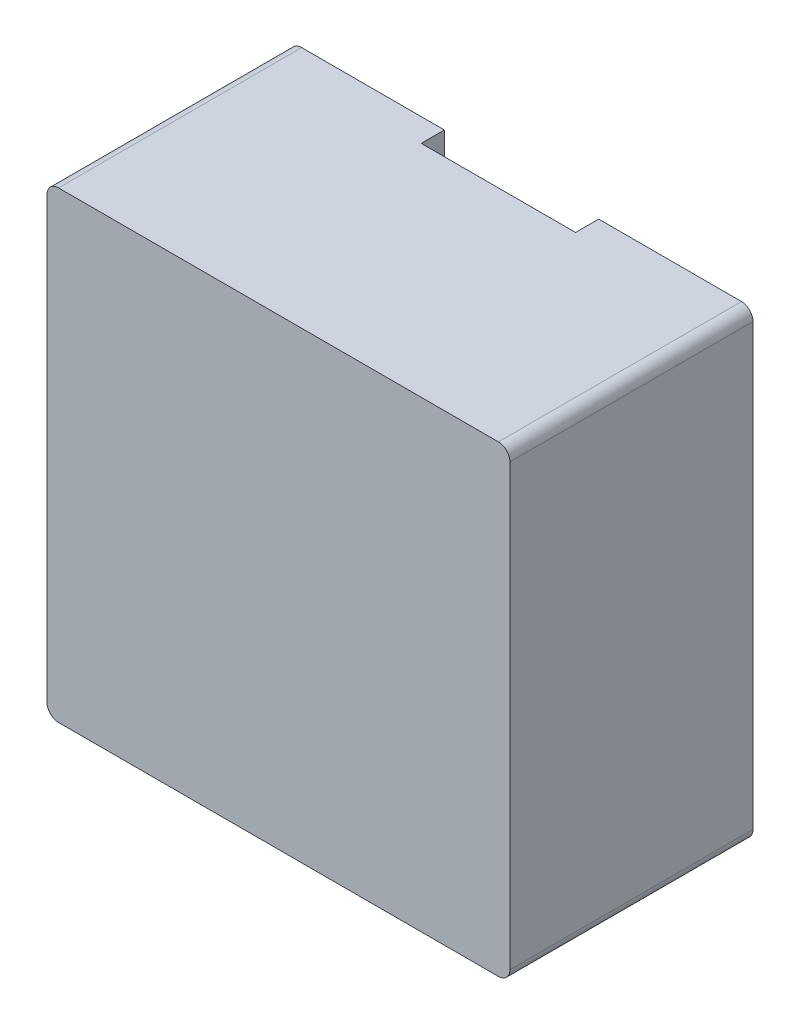
ISO-10303-21;
HEADER;
FILE_DESCRIPTION(('STEP AP214'),'2;1');
FILE_NAME('part.step','',(''),(''),'','','');
FILE_SCHEMA(('AUTOMOTIVE_DESIGN { 1 0 10303 214 1 1 1 1 }'));
ENDSEC;
DATA;
#1=APPLICATION_CONTEXT('core data for automotive mechanical design processes');
#2=APPLICATION_PROTOCOL_DEFINITION('international standard','automotive_design',2000,#1);
#3=PRODUCT_CONTEXT('',#1,'mechanical');
#4=PRODUCT('Part','Part','',(#3));
#5=PRODUCT_RELATED_PRODUCT_CATEGORY('part','',(#4));
#6=PRODUCT_DEFINITION_FORMATION('','',#4);
#7=PRODUCT_DEFINITION_CONTEXT('part definition',#1,'design');
#8=PRODUCT_DEFINITION('design','',#6,#7);
#9=PRODUCT_DEFINITION_SHAPE('','',#8);
#10=(LENGTH_UNIT() NAMED_UNIT(*) SI_UNIT(.MILLI.,.METRE.));
#11=(NAMED_UNIT(*) PLANE_ANGLE_UNIT() SI_UNIT($,.RADIAN.));
#12=(NAMED_UNIT(*) SI_UNIT($,.STERADIAN.) SOLID_ANGLE_UNIT());
#13=UNCERTAINTY_MEASURE_WITH_UNIT(LENGTH_MEASURE(1.E-05),#10,'distance_accuracy_value','');
#14=(GEOMETRIC_REPRESENTATION_CONTEXT(3) GLOBAL_UNCERTAINTY_ASSIGNED_CONTEXT((#13)) GLOBAL_UNIT_ASSIGNED_CONTEXT((#10,
#11,#12)) REPRESENTATION_CONTEXT('',''));
#15=CARTESIAN_POINT('',(0.,0.,0.));
#16=DIRECTION('',(0.,0.,1.));
#17=DIRECTION('',(1.,0.,0.));
#18=AXIS2_PLACEMENT_3D('',#15,#16,#17);
#19=CARTESIAN_POINT('',(1.,0.,0.));
#20=DIRECTION('',(-1.,0.,0.));
#21=DIRECTION('',(0.,0.,1.));
#22=AXIS2_PLACEMENT_3D('',#19,#20,#21);
#23=PLANE('',#22);
#24=DIRECTION('',(0.,1.,0.));
#25=VECTOR('',#24,1.);
#26=CARTESIAN_POINT('',(1.,0.,0.));
#27=LINE('',#26,#25);
#28=CARTESIAN_POINT('',(1.,-3.,0.));
#29=VERTEX_POINT('',#28);
#30=CARTESIAN_POINT('',(1.,3.,0.));
#31=VERTEX_POINT('',#30);
#32=EDGE_CURVE('E136',#29,#31,#27,.T.);
#33=ORIENTED_EDGE('',*,*,#32,.F.);
#34=DIRECTION('',(0.,0.,1.));
#35=VECTOR('',#34,1.);
#36=CARTESIAN_POINT('',(1.,-3.,0.));
#37=LINE('',#36,#35);
#38=CARTESIAN_POINT('',(1.,-3.,0.3));
#39=VERTEX_POINT('',#38);
#40=EDGE_CURVE('E164',#29,#39,#37,.T.);
#41=ORIENTED_EDGE('',*,*,#40,.T.);
#42=DIRECTION('',(0.,1.,0.));
#43=VECTOR('',#42,1.);
#44=CARTESIAN_POINT('',(1.,0.,0.3));
#45=LINE('',#44,#43);
#46=CARTESIAN_POINT('',(1.,3.,0.3));
#47=VERTEX_POINT('',#46);
#48=EDGE_CURVE('E140',#47,#39,#45,.F.);
#49=ORIENTED_EDGE('',*,*,#48,.F.);
#50=DIRECTION('',(0.,0.,1.));
#51=VECTOR('',#50,1.);
#52=CARTESIAN_POINT('',(1.,3.,0.));
#53=LINE('',#52,#51);
#54=EDGE_CURVE('E173',#47,#31,#53,.F.);
#55=ORIENTED_EDGE('',*,*,#54,.T.);
#56=EDGE_LOOP('',(#33,#41,#49,#55));
#57=FACE_BOUND('',#56,.T.);
#58=ADVANCED_FACE('F16',(#57),#23,.T.);
#59=CARTESIAN_POINT('',(-1.,0.,0.));
#60=DIRECTION('',(1.,0.,0.));
#61=DIRECTION('',(0.,0.,-1.));
#62=AXIS2_PLACEMENT_3D('',#59,#60,#61);
#63=PLANE('',#62);
#64=DIRECTION('',(0.,1.,0.));
#65=VECTOR('',#64,1.);
#66=CARTESIAN_POINT('',(-1.,0.,0.3));
#67=LINE('',#66,#65);
#68=CARTESIAN_POINT('',(-1.,-3.,0.3));
#69=VERTEX_POINT('',#68);
#70=CARTESIAN_POINT('',(-1.,3.,0.3));
#71=VERTEX_POINT('',#70);
#72=EDGE_CURVE('E180',#69,#71,#67,.T.);
#73=ORIENTED_EDGE('',*,*,#72,.F.);
#74=DIRECTION('',(0.,0.,-1.));
#75=VECTOR('',#74,1.);
#76=CARTESIAN_POINT('',(-1.,-3.,0.));
#77=LINE('',#76,#75);
#78=CARTESIAN_POINT('',(-1.,-3.,0.));
#79=VERTEX_POINT('',#78);
#80=EDGE_CURVE('E163',#69,#79,#77,.T.);
#81=ORIENTED_EDGE('',*,*,#80,.T.);
#82=DIRECTION('',(0.,1.,0.));
#83=VECTOR('',#82,1.);
#84=CARTESIAN_POINT('',(-1.,0.,0.));
#85=LINE('',#84,#83);
#86=CARTESIAN_POINT('',(-1.,3.,0.));
#87=VERTEX_POINT('',#86);
#88=EDGE_CURVE('E100',#87,#79,#85,.F.);
#89=ORIENTED_EDGE('',*,*,#88,.F.);
#90=DIRECTION('',(0.,0.,-1.));
#91=VECTOR('',#90,1.);
#92=CARTESIAN_POINT('',(-1.,3.,0.));
#93=LINE('',#92,#91);
#94=EDGE_CURVE('E109',#87,#71,#93,.F.);
#95=ORIENTED_EDGE('',*,*,#94,.T.);
#96=EDGE_LOOP('',(#73,#81,#89,#95));
#97=FACE_BOUND('',#96,.T.);
#98=ADVANCED_FACE('F240',(#97),#63,.T.);
#99=CARTESIAN_POINT('',(2.85,2.85,0.));
#100=DIRECTION('',(0.,0.,1.));
#101=DIRECTION('',(1.,0.,0.));
#102=AXIS2_PLACEMENT_3D('',#99,#100,#101);
#103=CYLINDRICAL_SURFACE('',#102,0.15);
#104=DIRECTION('',(0.,0.,-1.));
#105=VECTOR('',#104,1.);
#106=CARTESIAN_POINT('',(3.,2.85,0.));
#107=LINE('',#106,#105);
#108=CARTESIAN_POINT('',(3.,2.85,0.));
#109=VERTEX_POINT('',#108);
#110=CARTESIAN_POINT('',(3.,2.85,3.15));
#111=VERTEX_POINT('',#110);
#112=EDGE_CURVE('E111',#109,#111,#107,.F.);
#113=ORIENTED_EDGE('',*,*,#112,.F.);
#114=CARTESIAN_POINT('',(2.85,2.85,0.));
#115=DIRECTION('',(0.,0.,1.));
#116=DIRECTION('',(1.,0.,0.));
#117=AXIS2_PLACEMENT_3D('',#114,#115,#116);
#118=CIRCLE('',#117,0.15);
#119=CARTESIAN_POINT('',(2.85,3.,0.));
#120=VERTEX_POINT('',#119);
#121=EDGE_CURVE('E139',#120,#109,#118,.F.);
#122=ORIENTED_EDGE('',*,*,#121,.F.);
#123=DIRECTION('',(0.,0.,1.));
#124=VECTOR('',#123,1.);
#125=CARTESIAN_POINT('',(2.85,3.,0.));
#126=LINE('',#125,#124);
#127=CARTESIAN_POINT('',(2.85,3.,3.15));
#128=VERTEX_POINT('',#127);
#129=EDGE_CURVE('E115',#128,#120,#126,.F.);
#130=ORIENTED_EDGE('',*,*,#129,.F.);
#131=CARTESIAN_POINT('',(2.85,2.85,3.15));
#132=DIRECTION('',(0.,0.,1.));
#133=DIRECTION('',(1.,0.,0.));
#134=AXIS2_PLACEMENT_3D('',#131,#132,#133);
#135=CIRCLE('',#134,0.15);
#136=EDGE_CURVE('E19',#128,#111,#135,.F.);
#137=ORIENTED_EDGE('',*,*,#136,.T.);
#138=EDGE_LOOP('',(#113,#122,#130,#137));
#139=FACE_BOUND('',#138,.T.);
#140=ADVANCED_FACE('F208',(#139),#103,.T.);
#141=CARTESIAN_POINT('',(2.85,-2.85,0.));
#142=DIRECTION('',(0.,0.,1.));
#143=DIRECTION('',(1.,0.,0.));
#144=AXIS2_PLACEMENT_3D('',#141,#142,#143);
#145=CYLINDRICAL_SURFACE('',#144,0.15);
#146=DIRECTION('',(0.,0.,-1.));
#147=VECTOR('',#146,1.);
#148=CARTESIAN_POINT('',(2.85,-3.,0.));
#149=LINE('',#148,#147);
#150=CARTESIAN_POINT('',(2.85,-3.,0.));
#151=VERTEX_POINT('',#150);
#152=CARTESIAN_POINT('',(2.85,-3.,3.15));
#153=VERTEX_POINT('',#152);
#154=EDGE_CURVE('E154',#151,#153,#149,.F.);
#155=ORIENTED_EDGE('',*,*,#154,.F.);
#156=CARTESIAN_POINT('',(2.85,-2.85,0.));
#157=DIRECTION('',(0.,0.,1.));
#158=DIRECTION('',(1.,0.,0.));
#159=AXIS2_PLACEMENT_3D('',#156,#157,#158);
#160=CIRCLE('',#159,0.15);
#161=CARTESIAN_POINT('',(3.,-2.85,0.));
#162=VERTEX_POINT('',#161);
#163=EDGE_CURVE('E199',#162,#151,#160,.F.);
#164=ORIENTED_EDGE('',*,*,#163,.F.);
#165=DIRECTION('',(0.,0.,-1.));
#166=VECTOR('',#165,1.);
#167=CARTESIAN_POINT('',(3.,-2.85,0.));
#168=LINE('',#167,#166);
#169=CARTESIAN_POINT('',(3.,-2.85,3.15));
#170=VERTEX_POINT('',#169);
#171=EDGE_CURVE('E124',#170,#162,#168,.T.);
#172=ORIENTED_EDGE('',*,*,#171,.F.);
#173=CARTESIAN_POINT('',(2.85,-2.85,3.15));
#174=DIRECTION('',(0.,0.,1.));
#175=DIRECTION('',(1.,0.,0.));
#176=AXIS2_PLACEMENT_3D('',#173,#174,#175);
#177=CIRCLE('',#176,0.15);
#178=EDGE_CURVE('E183',#170,#153,#177,.F.);
#179=ORIENTED_EDGE('',*,*,#178,.T.);
#180=EDGE_LOOP('',(#155,#164,#172,#179));
#181=FACE_BOUND('',#180,.T.);
#182=ADVANCED_FACE('F260',(#181),#145,.T.);
#183=CARTESIAN_POINT('',(0.,0.,0.3));
#184=DIRECTION('',(0.,0.,-1.));
#185=DIRECTION('',(-1.,0.,0.));
#186=AXIS2_PLACEMENT_3D('',#183,#184,#185);
#187=PLANE('',#186);
#188=ORIENTED_EDGE('',*,*,#48,.T.);
#189=DIRECTION('',(1.,0.,0.));
#190=VECTOR('',#189,1.);
#191=CARTESIAN_POINT('',(0.,-3.,0.3));
#192=LINE('',#191,#190);
#193=EDGE_CURVE('E133',#69,#39,#192,.T.);
#194=ORIENTED_EDGE('',*,*,#193,.F.);
#195=ORIENTED_EDGE('',*,*,#72,.T.);
#196=DIRECTION('',(1.,0.,0.));
#197=VECTOR('',#196,1.);
#198=CARTESIAN_POINT('',(0.,3.,0.3));
#199=LINE('',#198,#197);
#200=EDGE_CURVE('E112',#47,#71,#199,.F.);
#201=ORIENTED_EDGE('',*,*,#200,.F.);
#202=EDGE_LOOP('',(#188,#194,#195,#201));
#203=FACE_BOUND('',#202,.T.);
#204=ADVANCED_FACE('F256',(#203),#187,.T.);
#205=CARTESIAN_POINT('',(0.,0.,0.));
#206=DIRECTION('',(0.,0.,-1.));
#207=DIRECTION('',(-1.,0.,0.));
#208=AXIS2_PLACEMENT_3D('',#205,#206,#207);
#209=PLANE('',#208);
#210=ORIENTED_EDGE('',*,*,#163,.T.);
#211=DIRECTION('',(1.,0.,0.));
#212=VECTOR('',#211,1.);
#213=CARTESIAN_POINT('',(0.,-3.,0.));
#214=LINE('',#213,#212);
#215=EDGE_CURVE('E130',#29,#151,#214,.T.);
#216=ORIENTED_EDGE('',*,*,#215,.F.);
#217=ORIENTED_EDGE('',*,*,#32,.T.);
#218=DIRECTION('',(1.,0.,0.));
#219=VECTOR('',#218,1.);
#220=CARTESIAN_POINT('',(0.,3.,0.));
#221=LINE('',#220,#219);
#222=EDGE_CURVE('E119',#120,#31,#221,.F.);
#223=ORIENTED_EDGE('',*,*,#222,.F.);
#224=ORIENTED_EDGE('',*,*,#121,.T.);
#225=DIRECTION('',(0.,1.,0.));
#226=VECTOR('',#225,1.);
#227=CARTESIAN_POINT('',(3.,0.,0.));
#228=LINE('',#227,#226);
#229=EDGE_CURVE('E152',#162,#109,#228,.T.);
#230=ORIENTED_EDGE('',*,*,#229,.F.);
#231=EDGE_LOOP('',(#210,#216,#217,#223,#224,#230));
#232=FACE_BOUND('',#231,.T.);
#233=ADVANCED_FACE('F259',(#232),#209,.T.);
#234=CARTESIAN_POINT('',(-2.85,2.85,0.));
#235=DIRECTION('',(0.,0.,1.));
#236=DIRECTION('',(1.,0.,0.));
#237=AXIS2_PLACEMENT_3D('',#234,#235,#236);
#238=CYLINDRICAL_SURFACE('',#237,0.15);
#239=DIRECTION('',(0.,0.,1.));
#240=VECTOR('',#239,1.);
#241=CARTESIAN_POINT('',(-3.,2.85,0.));
#242=LINE('',#241,#240);
#243=CARTESIAN_POINT('',(-3.,2.85,3.15));
#244=VERTEX_POINT('',#243);
#245=CARTESIAN_POINT('',(-3.,2.85,0.));
#246=VERTEX_POINT('',#245);
#247=EDGE_CURVE('E129',#244,#246,#242,.F.);
#248=ORIENTED_EDGE('',*,*,#247,.F.);
#249=CARTESIAN_POINT('',(-2.85,2.85,3.15));
#250=DIRECTION('',(0.,0.,1.));
#251=DIRECTION('',(1.,0.,0.));
#252=AXIS2_PLACEMENT_3D('',#249,#250,#251);
#253=CIRCLE('',#252,0.15);
#254=CARTESIAN_POINT('',(-2.85,3.,3.15));
#255=VERTEX_POINT('',#254);
#256=EDGE_CURVE('E34',#244,#255,#253,.F.);
#257=ORIENTED_EDGE('',*,*,#256,.T.);
#258=DIRECTION('',(0.,0.,1.));
#259=VECTOR('',#258,1.);
#260=CARTESIAN_POINT('',(-2.85,3.,0.));
#261=LINE('',#260,#259);
#262=CARTESIAN_POINT('',(-2.85,3.,0.));
#263=VERTEX_POINT('',#262);
#264=EDGE_CURVE('E106',#263,#255,#261,.T.);
#265=ORIENTED_EDGE('',*,*,#264,.F.);
#266=CARTESIAN_POINT('',(-2.85,2.85,0.));
#267=DIRECTION('',(0.,0.,1.));
#268=DIRECTION('',(1.,0.,0.));
#269=AXIS2_PLACEMENT_3D('',#266,#267,#268);
#270=CIRCLE('',#269,0.15);
#271=EDGE_CURVE('E94',#246,#263,#270,.F.);
#272=ORIENTED_EDGE('',*,*,#271,.F.);
#273=EDGE_LOOP('',(#248,#257,#265,#272));
#274=FACE_BOUND('',#273,.T.);
#275=ADVANCED_FACE('F114',(#274),#238,.T.);
#276=CARTESIAN_POINT('',(0.,0.,0.));
#277=DIRECTION('',(0.,0.,-1.));
#278=DIRECTION('',(-1.,0.,0.));
#279=AXIS2_PLACEMENT_3D('',#276,#277,#278);
#280=PLANE('',#279);
#281=ORIENTED_EDGE('',*,*,#271,.T.);
#282=DIRECTION('',(1.,0.,0.));
#283=VECTOR('',#282,1.);
#284=CARTESIAN_POINT('',(0.,3.,0.));
#285=LINE('',#284,#283);
#286=EDGE_CURVE('E98',#87,#263,#285,.F.);
#287=ORIENTED_EDGE('',*,*,#286,.F.);
#288=ORIENTED_EDGE('',*,*,#88,.T.);
#289=DIRECTION('',(1.,0.,0.));
#290=VECTOR('',#289,1.);
#291=CARTESIAN_POINT('',(0.,-3.,0.));
#292=LINE('',#291,#290);
#293=CARTESIAN_POINT('',(-2.85,-3.,0.));
#294=VERTEX_POINT('',#293);
#295=EDGE_CURVE('E143',#294,#79,#292,.T.);
#296=ORIENTED_EDGE('',*,*,#295,.F.);
#297=CARTESIAN_POINT('',(-2.85,-2.85,0.));
#298=DIRECTION('',(0.,0.,1.));
#299=DIRECTION('',(1.,0.,0.));
#300=AXIS2_PLACEMENT_3D('',#297,#298,#299);
#301=CIRCLE('',#300,0.15);
#302=CARTESIAN_POINT('',(-3.,-2.85,0.));
#303=VERTEX_POINT('',#302);
#304=EDGE_CURVE('E116',#303,#294,#301,.T.);
#305=ORIENTED_EDGE('',*,*,#304,.F.);
#306=DIRECTION('',(0.,1.,0.));
#307=VECTOR('',#306,1.);
#308=CARTESIAN_POINT('',(-3.,0.,0.));
#309=LINE('',#308,#307);
#310=EDGE_CURVE('E83',#246,#303,#309,.F.);
#311=ORIENTED_EDGE('',*,*,#310,.F.);
#312=EDGE_LOOP('',(#281,#287,#288,#296,#305,#311));
#313=FACE_BOUND('',#312,.T.);
#314=ADVANCED_FACE('F96',(#313),#280,.T.);
#315=CARTESIAN_POINT('',(-2.85,-2.85,0.));
#316=DIRECTION('',(0.,0.,1.));
#317=DIRECTION('',(1.,0.,0.));
#318=AXIS2_PLACEMENT_3D('',#315,#316,#317);
#319=CYLINDRICAL_SURFACE('',#318,0.15);
#320=DIRECTION('',(0.,0.,1.));
#321=VECTOR('',#320,1.);
#322=CARTESIAN_POINT('',(-3.,-2.85,0.));
#323=LINE('',#322,#321);
#324=CARTESIAN_POINT('',(-3.,-2.85,3.15));
#325=VERTEX_POINT('',#324);
#326=EDGE_CURVE('E128',#303,#325,#323,.T.);
#327=ORIENTED_EDGE('',*,*,#326,.F.);
#328=ORIENTED_EDGE('',*,*,#304,.T.);
#329=DIRECTION('',(0.,0.,-1.));
#330=VECTOR('',#329,1.);
#331=CARTESIAN_POINT('',(-2.85,-3.,0.));
#332=LINE('',#331,#330);
#333=CARTESIAN_POINT('',(-2.85,-3.,3.15));
#334=VERTEX_POINT('',#333);
#335=EDGE_CURVE('E146',#334,#294,#332,.T.);
#336=ORIENTED_EDGE('',*,*,#335,.F.);
#337=CARTESIAN_POINT('',(-2.85,-2.85,3.15));
#338=DIRECTION('',(0.,0.,1.));
#339=DIRECTION('',(1.,0.,0.));
#340=AXIS2_PLACEMENT_3D('',#337,#338,#339);
#341=CIRCLE('',#340,0.15);
#342=EDGE_CURVE('E99',#334,#325,#341,.F.);
#343=ORIENTED_EDGE('',*,*,#342,.T.);
#344=EDGE_LOOP('',(#327,#328,#336,#343));
#345=FACE_BOUND('',#344,.T.);
#346=ADVANCED_FACE('F261',(#345),#319,.T.);
#347=CARTESIAN_POINT('',(0.,3.,0.));
#348=DIRECTION('',(0.,1.,0.));
#349=DIRECTION('',(0.,0.,1.));
#350=AXIS2_PLACEMENT_3D('',#347,#348,#349);
#351=PLANE('',#350);
#352=ORIENTED_EDGE('',*,*,#94,.F.);
#353=ORIENTED_EDGE('',*,*,#286,.T.);
#354=ORIENTED_EDGE('',*,*,#264,.T.);
#355=DIRECTION('',(-1.,0.,0.));
#356=VECTOR('',#355,1.);
#357=CARTESIAN_POINT('',(0.,3.,3.15));
#358=LINE('',#357,#356);
#359=EDGE_CURVE('E217',#255,#128,#358,.F.);
#360=ORIENTED_EDGE('',*,*,#359,.T.);
#361=ORIENTED_EDGE('',*,*,#129,.T.);
#362=ORIENTED_EDGE('',*,*,#222,.T.);
#363=ORIENTED_EDGE('',*,*,#54,.F.);
#364=ORIENTED_EDGE('',*,*,#200,.T.);
#365=EDGE_LOOP('',(#352,#353,#354,#360,#361,#362,#363,#364));
#366=FACE_BOUND('',#365,.T.);
#367=ADVANCED_FACE('F104',(#366),#351,.T.);
#368=CARTESIAN_POINT('',(3.,0.,0.));
#369=DIRECTION('',(1.,0.,0.));
#370=DIRECTION('',(0.,0.,-1.));
#371=AXIS2_PLACEMENT_3D('',#368,#369,#370);
#372=PLANE('',#371);
#373=ORIENTED_EDGE('',*,*,#171,.T.);
#374=ORIENTED_EDGE('',*,*,#229,.T.);
#375=ORIENTED_EDGE('',*,*,#112,.T.);
#376=DIRECTION('',(0.,1.,0.));
#377=VECTOR('',#376,1.);
#378=CARTESIAN_POINT('',(3.,0.,3.15));
#379=LINE('',#378,#377);
#380=EDGE_CURVE('E213',#111,#170,#379,.F.);
#381=ORIENTED_EDGE('',*,*,#380,.T.);
#382=EDGE_LOOP('',(#373,#374,#375,#381));
#383=FACE_BOUND('',#382,.T.);
#384=ADVANCED_FACE('F212',(#383),#372,.T.);
#385=CARTESIAN_POINT('',(0.,-3.,0.));
#386=DIRECTION('',(0.,-1.,0.));
#387=DIRECTION('',(0.,0.,-1.));
#388=AXIS2_PLACEMENT_3D('',#385,#386,#387);
#389=PLANE('',#388);
#390=ORIENTED_EDGE('',*,*,#40,.F.);
#391=ORIENTED_EDGE('',*,*,#215,.T.);
#392=ORIENTED_EDGE('',*,*,#154,.T.);
#393=DIRECTION('',(-1.,0.,0.));
#394=VECTOR('',#393,1.);
#395=CARTESIAN_POINT('',(0.,-3.,3.15));
#396=LINE('',#395,#394);
#397=EDGE_CURVE('E25',#153,#334,#396,.T.);
#398=ORIENTED_EDGE('',*,*,#397,.T.);
#399=ORIENTED_EDGE('',*,*,#335,.T.);
#400=ORIENTED_EDGE('',*,*,#295,.T.);
#401=ORIENTED_EDGE('',*,*,#80,.F.);
#402=ORIENTED_EDGE('',*,*,#193,.T.);
#403=EDGE_LOOP('',(#390,#391,#392,#398,#399,#400,#401,#402));
#404=FACE_BOUND('',#403,.T.);
#405=ADVANCED_FACE('F231',(#404),#389,.T.);
#406=CARTESIAN_POINT('',(-3.,0.,0.));
#407=DIRECTION('',(-1.,0.,0.));
#408=DIRECTION('',(0.,0.,1.));
#409=AXIS2_PLACEMENT_3D('',#406,#407,#408);
#410=PLANE('',#409);
#411=ORIENTED_EDGE('',*,*,#326,.T.);
#412=DIRECTION('',(0.,1.,0.));
#413=VECTOR('',#412,1.);
#414=CARTESIAN_POINT('',(-3.,0.,3.15));
#415=LINE('',#414,#413);
#416=EDGE_CURVE('E10',#325,#244,#415,.T.);
#417=ORIENTED_EDGE('',*,*,#416,.T.);
#418=ORIENTED_EDGE('',*,*,#247,.T.);
#419=ORIENTED_EDGE('',*,*,#310,.T.);
#420=EDGE_LOOP('',(#411,#417,#418,#419));
#421=FACE_BOUND('',#420,.T.);
#422=ADVANCED_FACE('F262',(#421),#410,.T.);
#423=CARTESIAN_POINT('',(0.,0.,3.15));
#424=DIRECTION('',(0.,0.,-1.));
#425=DIRECTION('',(-1.,0.,0.));
#426=AXIS2_PLACEMENT_3D('',#423,#424,#425);
#427=PLANE('',#426);
#428=ORIENTED_EDGE('',*,*,#416,.F.);
#429=ORIENTED_EDGE('',*,*,#342,.F.);
#430=ORIENTED_EDGE('',*,*,#397,.F.);
#431=ORIENTED_EDGE('',*,*,#178,.F.);
#432=ORIENTED_EDGE('',*,*,#380,.F.);
#433=ORIENTED_EDGE('',*,*,#136,.F.);
#434=ORIENTED_EDGE('',*,*,#359,.F.);
#435=ORIENTED_EDGE('',*,*,#256,.F.);
#436=EDGE_LOOP('',(#428,#429,#430,#431,#432,#433,#434,#435));
#437=FACE_BOUND('',#436,.T.);
#438=ADVANCED_FACE('F215',(#437),#427,.F.);
#439=CLOSED_SHELL('',(#58,#98,#140,#182,#204,#233,#275,#314,#346,#367,#384,#405,#422,#438));
#440=MANIFOLD_SOLID_BREP('B1',#439);
#441=ADVANCED_BREP_SHAPE_REPRESENTATION('',(#18,#440),#14);
#442=SHAPE_DEFINITION_REPRESENTATION(#9,#441);
ENDSEC;
END-ISO-10303-21;
